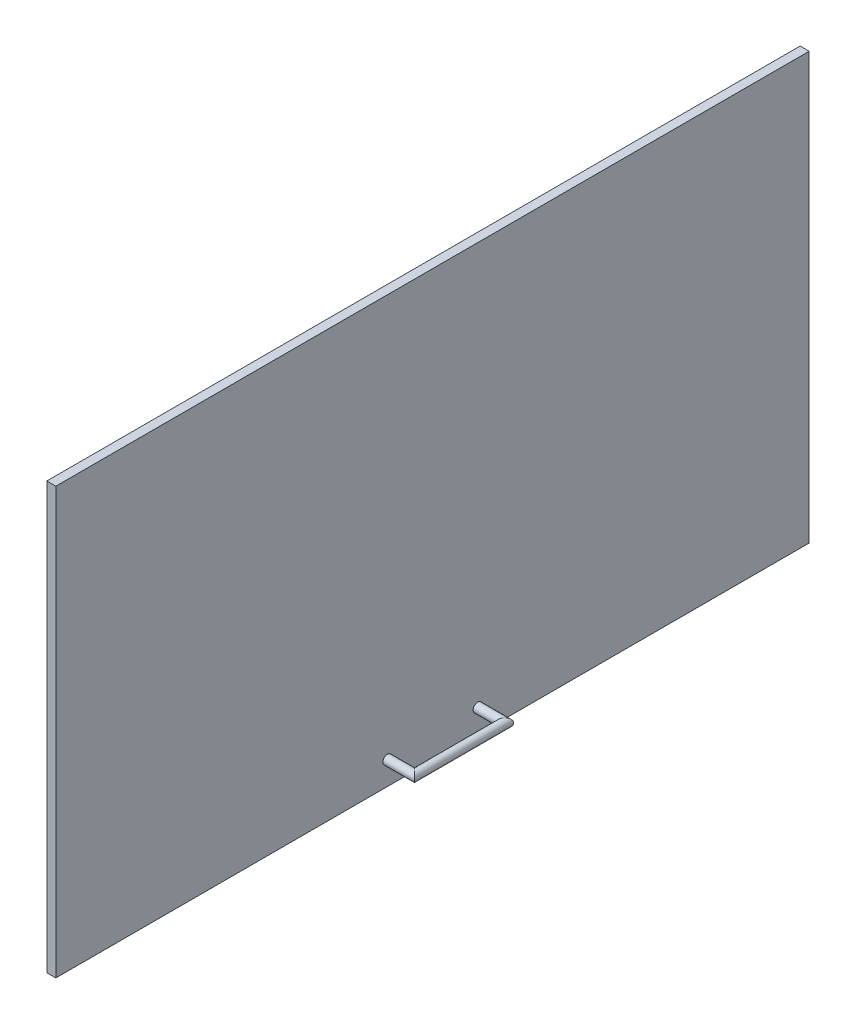
ISO-10303-21;
HEADER;
FILE_DESCRIPTION(('STEP AP214'),'2;1');
FILE_NAME('part.step','',(''),(''),'','','');
FILE_SCHEMA(('AUTOMOTIVE_DESIGN { 1 0 10303 214 1 1 1 1 }'));
ENDSEC;
DATA;
#1=APPLICATION_CONTEXT('core data for automotive mechanical design processes');
#2=APPLICATION_PROTOCOL_DEFINITION('international standard','automotive_design',2000,#1);
#3=PRODUCT_CONTEXT('',#1,'mechanical');
#4=PRODUCT('Part','Part','',(#3));
#5=PRODUCT_RELATED_PRODUCT_CATEGORY('part','',(#4));
#6=PRODUCT_DEFINITION_FORMATION('','',#4);
#7=PRODUCT_DEFINITION_CONTEXT('part definition',#1,'design');
#8=PRODUCT_DEFINITION('design','',#6,#7);
#9=PRODUCT_DEFINITION_SHAPE('','',#8);
#10=(LENGTH_UNIT() NAMED_UNIT(*) SI_UNIT(.MILLI.,.METRE.));
#11=(NAMED_UNIT(*) PLANE_ANGLE_UNIT() SI_UNIT($,.RADIAN.));
#12=(NAMED_UNIT(*) SI_UNIT($,.STERADIAN.) SOLID_ANGLE_UNIT());
#13=UNCERTAINTY_MEASURE_WITH_UNIT(LENGTH_MEASURE(1.E-05),#10,'distance_accuracy_value','');
#14=(GEOMETRIC_REPRESENTATION_CONTEXT(3) GLOBAL_UNCERTAINTY_ASSIGNED_CONTEXT((#13)) GLOBAL_UNIT_ASSIGNED_CONTEXT((#10,
#11,#12)) REPRESENTATION_CONTEXT('',''));
#15=CARTESIAN_POINT('',(0.,0.,0.));
#16=DIRECTION('',(0.,0.,1.));
#17=DIRECTION('',(1.,0.,0.));
#18=AXIS2_PLACEMENT_3D('',#15,#16,#17);
#19=CARTESIAN_POINT('',(10.,0.,0.));
#20=DIRECTION('',(-1.,0.,0.));
#21=DIRECTION('',(0.,0.,1.));
#22=AXIS2_PLACEMENT_3D('',#19,#20,#21);
#23=PLANE('',#22);
#24=CARTESIAN_POINT('',(10.,-210.,-50.));
#25=DIRECTION('',(1.,0.,0.));
#26=DIRECTION('',(0.,0.,-1.));
#27=AXIS2_PLACEMENT_3D('',#24,#25,#26);
#28=CIRCLE('',#27,4.99999999999999);
#29=CARTESIAN_POINT('',(10.,-210.,-55.));
#30=VERTEX_POINT('',#29);
#31=EDGE_CURVE('E11',#30,#30,#28,.T.);
#32=ORIENTED_EDGE('',*,*,#31,.F.);
#33=EDGE_LOOP('',(#32));
#34=FACE_BOUND('',#33,.T.);
#35=DIRECTION('',(0.,1.,0.));
#36=VECTOR('',#35,1.);
#37=CARTESIAN_POINT('',(10.,-235.955,-417.4));
#38=LINE('',#37,#36);
#39=CARTESIAN_POINT('',(10.,-235.955,-417.4));
#40=VERTEX_POINT('',#39);
#41=CARTESIAN_POINT('',(10.,235.955,-417.4));
#42=VERTEX_POINT('',#41);
#43=EDGE_CURVE('E111',#40,#42,#38,.T.);
#44=ORIENTED_EDGE('',*,*,#43,.T.);
#45=DIRECTION('',(0.,0.,1.));
#46=VECTOR('',#45,1.);
#47=CARTESIAN_POINT('',(10.,235.955,417.4));
#48=LINE('',#47,#46);
#49=CARTESIAN_POINT('',(10.,235.955,417.4));
#50=VERTEX_POINT('',#49);
#51=EDGE_CURVE('E87',#42,#50,#48,.T.);
#52=ORIENTED_EDGE('',*,*,#51,.T.);
#53=DIRECTION('',(0.,-1.,0.));
#54=VECTOR('',#53,1.);
#55=CARTESIAN_POINT('',(10.,-235.955,417.4));
#56=LINE('',#55,#54);
#57=CARTESIAN_POINT('',(10.,-235.955,417.4));
#58=VERTEX_POINT('',#57);
#59=EDGE_CURVE('E114',#50,#58,#56,.T.);
#60=ORIENTED_EDGE('',*,*,#59,.T.);
#61=DIRECTION('',(0.,0.,-1.));
#62=VECTOR('',#61,1.);
#63=CARTESIAN_POINT('',(10.,-235.955,417.4));
#64=LINE('',#63,#62);
#65=EDGE_CURVE('E55',#58,#40,#64,.T.);
#66=ORIENTED_EDGE('',*,*,#65,.T.);
#67=EDGE_LOOP('',(#44,#52,#60,#66));
#68=FACE_BOUND('',#67,.T.);
#69=CARTESIAN_POINT('',(10.,-210.,50.));
#70=DIRECTION('',(-1.,0.,0.));
#71=DIRECTION('',(0.,0.,1.));
#72=AXIS2_PLACEMENT_3D('',#69,#70,#71);
#73=CIRCLE('',#72,4.99999999999999);
#74=CARTESIAN_POINT('',(10.,-210.,55.));
#75=VERTEX_POINT('',#74);
#76=EDGE_CURVE('E106',#75,#75,#73,.T.);
#77=ORIENTED_EDGE('',*,*,#76,.T.);
#78=EDGE_LOOP('',(#77));
#79=FACE_BOUND('',#78,.T.);
#80=ADVANCED_FACE('F37',(#34,#68,#79),#23,.F.);
#81=CARTESIAN_POINT('',(10.,-235.955,-417.4));
#82=DIRECTION('',(0.,0.,1.));
#83=DIRECTION('',(1.,0.,0.));
#84=AXIS2_PLACEMENT_3D('',#81,#82,#83);
#85=PLANE('',#84);
#86=DIRECTION('',(0.,1.,0.));
#87=VECTOR('',#86,1.);
#88=CARTESIAN_POINT('',(0.,-235.955,-417.4));
#89=LINE('',#88,#87);
#90=CARTESIAN_POINT('',(0.,-235.955,-417.4));
#91=VERTEX_POINT('',#90);
#92=CARTESIAN_POINT('',(0.,235.955,-417.4));
#93=VERTEX_POINT('',#92);
#94=EDGE_CURVE('E99',#91,#93,#89,.T.);
#95=ORIENTED_EDGE('',*,*,#94,.T.);
#96=DIRECTION('',(-1.,0.,0.));
#97=VECTOR('',#96,1.);
#98=CARTESIAN_POINT('',(10.,235.955,-417.4));
#99=LINE('',#98,#97);
#100=EDGE_CURVE('E41',#42,#93,#99,.T.);
#101=ORIENTED_EDGE('',*,*,#100,.F.);
#102=ORIENTED_EDGE('',*,*,#43,.F.);
#103=DIRECTION('',(-1.,0.,0.));
#104=VECTOR('',#103,1.);
#105=CARTESIAN_POINT('',(10.,-235.955,-417.4));
#106=LINE('',#105,#104);
#107=EDGE_CURVE('E116',#40,#91,#106,.T.);
#108=ORIENTED_EDGE('',*,*,#107,.T.);
#109=EDGE_LOOP('',(#95,#101,#102,#108));
#110=FACE_BOUND('',#109,.T.);
#111=ADVANCED_FACE('F39',(#110),#85,.F.);
#112=CARTESIAN_POINT('',(10.,235.955,417.4));
#113=DIRECTION('',(0.,-1.,0.));
#114=DIRECTION('',(0.,0.,-1.));
#115=AXIS2_PLACEMENT_3D('',#112,#113,#114);
#116=PLANE('',#115);
#117=DIRECTION('',(0.,0.,1.));
#118=VECTOR('',#117,1.);
#119=CARTESIAN_POINT('',(0.,235.955,417.4));
#120=LINE('',#119,#118);
#121=CARTESIAN_POINT('',(0.,235.955,417.4));
#122=VERTEX_POINT('',#121);
#123=EDGE_CURVE('E103',#93,#122,#120,.T.);
#124=ORIENTED_EDGE('',*,*,#123,.T.);
#125=DIRECTION('',(-1.,0.,0.));
#126=VECTOR('',#125,1.);
#127=CARTESIAN_POINT('',(10.,235.955,417.4));
#128=LINE('',#127,#126);
#129=EDGE_CURVE('E123',#50,#122,#128,.T.);
#130=ORIENTED_EDGE('',*,*,#129,.F.);
#131=ORIENTED_EDGE('',*,*,#51,.F.);
#132=ORIENTED_EDGE('',*,*,#100,.T.);
#133=EDGE_LOOP('',(#124,#130,#131,#132));
#134=FACE_BOUND('',#133,.T.);
#135=ADVANCED_FACE('F126',(#134),#116,.F.);
#136=CARTESIAN_POINT('',(10.,-235.955,417.4));
#137=DIRECTION('',(0.,0.,-1.));
#138=DIRECTION('',(-1.,0.,0.));
#139=AXIS2_PLACEMENT_3D('',#136,#137,#138);
#140=PLANE('',#139);
#141=DIRECTION('',(0.,-1.,0.));
#142=VECTOR('',#141,1.);
#143=CARTESIAN_POINT('',(0.,-235.955,417.4));
#144=LINE('',#143,#142);
#145=CARTESIAN_POINT('',(0.,-235.955,417.4));
#146=VERTEX_POINT('',#145);
#147=EDGE_CURVE('E73',#122,#146,#144,.T.);
#148=ORIENTED_EDGE('',*,*,#147,.T.);
#149=DIRECTION('',(-1.,0.,0.));
#150=VECTOR('',#149,1.);
#151=CARTESIAN_POINT('',(10.,-235.955,417.4));
#152=LINE('',#151,#150);
#153=EDGE_CURVE('E122',#58,#146,#152,.T.);
#154=ORIENTED_EDGE('',*,*,#153,.F.);
#155=ORIENTED_EDGE('',*,*,#59,.F.);
#156=ORIENTED_EDGE('',*,*,#129,.T.);
#157=EDGE_LOOP('',(#148,#154,#155,#156));
#158=FACE_BOUND('',#157,.T.);
#159=ADVANCED_FACE('F143',(#158),#140,.F.);
#160=CARTESIAN_POINT('',(10.,-235.955,417.4));
#161=DIRECTION('',(0.,1.,0.));
#162=DIRECTION('',(0.,0.,1.));
#163=AXIS2_PLACEMENT_3D('',#160,#161,#162);
#164=PLANE('',#163);
#165=DIRECTION('',(0.,0.,-1.));
#166=VECTOR('',#165,1.);
#167=CARTESIAN_POINT('',(0.,-235.955,417.4));
#168=LINE('',#167,#166);
#169=EDGE_CURVE('E79',#146,#91,#168,.T.);
#170=ORIENTED_EDGE('',*,*,#169,.T.);
#171=ORIENTED_EDGE('',*,*,#107,.F.);
#172=ORIENTED_EDGE('',*,*,#65,.F.);
#173=ORIENTED_EDGE('',*,*,#153,.T.);
#174=EDGE_LOOP('',(#170,#171,#172,#173));
#175=FACE_BOUND('',#174,.T.);
#176=ADVANCED_FACE('F134',(#175),#164,.F.);
#177=CARTESIAN_POINT('',(0.,0.,0.));
#178=DIRECTION('',(-1.,0.,0.));
#179=DIRECTION('',(0.,0.,1.));
#180=AXIS2_PLACEMENT_3D('',#177,#178,#179);
#181=PLANE('',#180);
#182=ORIENTED_EDGE('',*,*,#94,.F.);
#183=ORIENTED_EDGE('',*,*,#169,.F.);
#184=ORIENTED_EDGE('',*,*,#147,.F.);
#185=ORIENTED_EDGE('',*,*,#123,.F.);
#186=EDGE_LOOP('',(#182,#183,#184,#185));
#187=FACE_BOUND('',#186,.T.);
#188=ADVANCED_FACE('F131',(#187),#181,.T.);
#189=CARTESIAN_POINT('',(45.6,-210.,50.));
#190=DIRECTION('',(-1.,0.,0.));
#191=DIRECTION('',(0.,0.,1.));
#192=AXIS2_PLACEMENT_3D('',#189,#190,#191);
#193=CYLINDRICAL_SURFACE('',#192,4.99999999999999);
#194=CARTESIAN_POINT('',(40.,-210.,50.));
#195=DIRECTION('',(-0.707106781186547,0.,0.707106781186548));
#196=DIRECTION('',(0.707106781186548,0.,0.707106781186547));
#197=AXIS2_PLACEMENT_3D('',#194,#195,#196);
#198=ELLIPSE('',#197,7.07106781186546,4.99999999999999);
#199=CARTESIAN_POINT('',(45.,-210.,55.));
#200=VERTEX_POINT('',#199);
#201=EDGE_CURVE('E100',#200,#200,#198,.F.);
#202=ORIENTED_EDGE('',*,*,#201,.F.);
#203=EDGE_LOOP('',(#202));
#204=FACE_BOUND('',#203,.T.);
#205=ORIENTED_EDGE('',*,*,#76,.F.);
#206=EDGE_LOOP('',(#205));
#207=FACE_BOUND('',#206,.T.);
#208=ADVANCED_FACE('F133',(#204,#207),#193,.T.);
#209=CARTESIAN_POINT('',(40.,-210.,-55.6000000000001));
#210=DIRECTION('',(0.,0.,1.));
#211=DIRECTION('',(1.,0.,0.));
#212=AXIS2_PLACEMENT_3D('',#209,#210,#211);
#213=CYLINDRICAL_SURFACE('',#212,4.99999999999999);
#214=CARTESIAN_POINT('',(40.,-210.,-50.0000000000001));
#215=DIRECTION('',(0.707106781186548,0.,0.707106781186547));
#216=DIRECTION('',(0.707106781186547,0.,-0.707106781186548));
#217=AXIS2_PLACEMENT_3D('',#214,#215,#216);
#218=ELLIPSE('',#217,7.07106781186547,4.99999999999999);
#219=CARTESIAN_POINT('',(45.,-210.,-55.0000000000001));
#220=VERTEX_POINT('',#219);
#221=EDGE_CURVE('E95',#220,#220,#218,.F.);
#222=ORIENTED_EDGE('',*,*,#221,.F.);
#223=EDGE_LOOP('',(#222));
#224=FACE_BOUND('',#223,.T.);
#225=ORIENTED_EDGE('',*,*,#201,.T.);
#226=EDGE_LOOP('',(#225));
#227=FACE_BOUND('',#226,.T.);
#228=ADVANCED_FACE('F96',(#224,#227),#213,.T.);
#229=CARTESIAN_POINT('',(10.,-210.,-50.));
#230=DIRECTION('',(1.,0.,0.));
#231=DIRECTION('',(0.,0.,-1.));
#232=AXIS2_PLACEMENT_3D('',#229,#230,#231);
#233=CYLINDRICAL_SURFACE('',#232,4.99999999999999);
#234=ORIENTED_EDGE('',*,*,#31,.T.);
#235=EDGE_LOOP('',(#234));
#236=FACE_BOUND('',#235,.T.);
#237=ORIENTED_EDGE('',*,*,#221,.T.);
#238=EDGE_LOOP('',(#237));
#239=FACE_BOUND('',#238,.T.);
#240=ADVANCED_FACE('F136',(#236,#239),#233,.T.);
#241=CLOSED_SHELL('',(#80,#111,#135,#159,#176,#188,#208,#228,#240));
#242=MANIFOLD_SOLID_BREP('B2',#241);
#243=ADVANCED_BREP_SHAPE_REPRESENTATION('',(#18,#242),#14);
#244=SHAPE_DEFINITION_REPRESENTATION(#9,#243);
ENDSEC;
END-ISO-10303-21;
